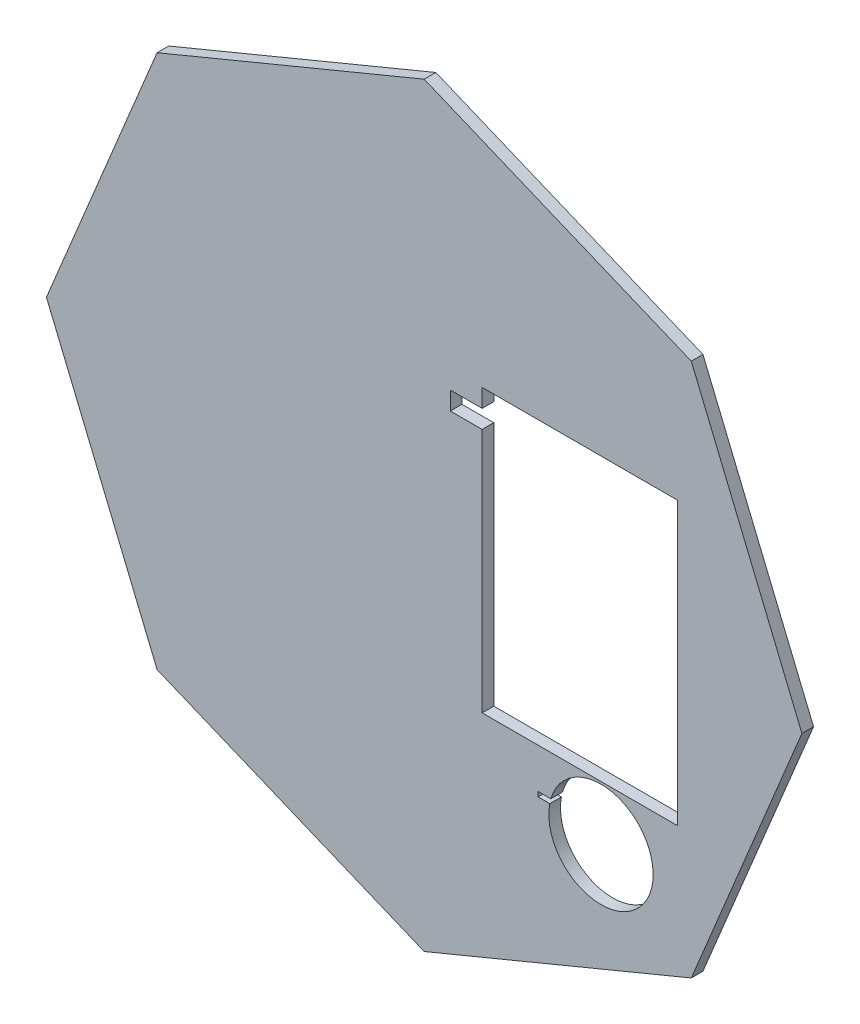
ISO-10303-21;
HEADER;
FILE_DESCRIPTION(('STEP AP214'),'2;1');
FILE_NAME('part.step','',(''),(''),'','','');
FILE_SCHEMA(('AUTOMOTIVE_DESIGN { 1 0 10303 214 1 1 1 1 }'));
ENDSEC;
DATA;
#1=APPLICATION_CONTEXT('core data for automotive mechanical design processes');
#2=APPLICATION_PROTOCOL_DEFINITION('international standard','automotive_design',2000,#1);
#3=PRODUCT_CONTEXT('',#1,'mechanical');
#4=PRODUCT('Part','Part','',(#3));
#5=PRODUCT_RELATED_PRODUCT_CATEGORY('part','',(#4));
#6=PRODUCT_DEFINITION_FORMATION('','',#4);
#7=PRODUCT_DEFINITION_CONTEXT('part definition',#1,'design');
#8=PRODUCT_DEFINITION('design','',#6,#7);
#9=PRODUCT_DEFINITION_SHAPE('','',#8);
#10=(LENGTH_UNIT() NAMED_UNIT(*) SI_UNIT(.MILLI.,.METRE.));
#11=(NAMED_UNIT(*) PLANE_ANGLE_UNIT() SI_UNIT($,.RADIAN.));
#12=(NAMED_UNIT(*) SI_UNIT($,.STERADIAN.) SOLID_ANGLE_UNIT());
#13=UNCERTAINTY_MEASURE_WITH_UNIT(LENGTH_MEASURE(1.E-05),#10,'distance_accuracy_value','');
#14=(GEOMETRIC_REPRESENTATION_CONTEXT(3) GLOBAL_UNCERTAINTY_ASSIGNED_CONTEXT((#13)) GLOBAL_UNIT_ASSIGNED_CONTEXT((#10,
#11,#12)) REPRESENTATION_CONTEXT('',''));
#15=CARTESIAN_POINT('',(0.,0.,0.));
#16=DIRECTION('',(0.,0.,1.));
#17=DIRECTION('',(1.,0.,0.));
#18=AXIS2_PLACEMENT_3D('',#15,#16,#17);
#19=CARTESIAN_POINT('',(0.,0.,13.2099665865153));
#20=DIRECTION('',(0.,0.,1.));
#21=DIRECTION('',(1.,0.,0.));
#22=AXIS2_PLACEMENT_3D('',#19,#20,#21);
#23=PLANE('',#22);
#24=DIRECTION('',(0.,-1.,0.));
#25=VECTOR('',#24,1.);
#26=CARTESIAN_POINT('',(53.6957855668647,14.1177242344918,13.2099665865153));
#27=LINE('',#26,#25);
#28=CARTESIAN_POINT('',(53.6957855668647,14.1177242344918,13.2099665865153));
#29=VERTEX_POINT('',#28);
#30=CARTESIAN_POINT('',(53.6957855668647,-17.3782779627732,13.2099665865153));
#31=VERTEX_POINT('',#30);
#32=EDGE_CURVE('E207',#29,#31,#27,.T.);
#33=ORIENTED_EDGE('',*,*,#32,.F.);
#34=DIRECTION('',(1.,0.,0.));
#35=VECTOR('',#34,1.);
#36=CARTESIAN_POINT('',(53.6957855668647,14.1177242344918,13.2099665865153));
#37=LINE('',#36,#35);
#38=CARTESIAN_POINT('',(31.8517761674547,14.1177242344918,13.2099665865153));
#39=VERTEX_POINT('',#38);
#40=EDGE_CURVE('E223',#39,#29,#37,.T.);
#41=ORIENTED_EDGE('',*,*,#40,.F.);
#42=DIRECTION('',(0.,1.,0.));
#43=VECTOR('',#42,1.);
#44=CARTESIAN_POINT('',(31.8517761674547,14.1177242344918,13.2099665865153));
#45=LINE('',#44,#43);
#46=CARTESIAN_POINT('',(31.8517761674547,12.0857189244338,13.2099665865153));
#47=VERTEX_POINT('',#46);
#48=EDGE_CURVE('E220',#47,#39,#45,.T.);
#49=ORIENTED_EDGE('',*,*,#48,.F.);
#50=DIRECTION('',(1.,0.,0.));
#51=VECTOR('',#50,1.);
#52=CARTESIAN_POINT('',(28.2957764115947,12.0857189244338,13.2099665865153));
#53=LINE('',#52,#51);
#54=CARTESIAN_POINT('',(28.2957764115947,12.0857189244338,13.2099665865153));
#55=VERTEX_POINT('',#54);
#56=EDGE_CURVE('E218',#55,#47,#53,.T.);
#57=ORIENTED_EDGE('',*,*,#56,.F.);
#58=DIRECTION('',(0.,1.,0.));
#59=VECTOR('',#58,1.);
#60=CARTESIAN_POINT('',(28.2957764115947,12.0857189244338,13.2099665865153));
#61=LINE('',#60,#59);
#62=CARTESIAN_POINT('',(28.2957764115947,10.0537212437698,13.2099665865153));
#63=VERTEX_POINT('',#62);
#64=EDGE_CURVE('E216',#63,#55,#61,.T.);
#65=ORIENTED_EDGE('',*,*,#64,.F.);
#66=DIRECTION('',(-1.,0.,0.));
#67=VECTOR('',#66,1.);
#68=CARTESIAN_POINT('',(28.2957764115947,10.0537212437698,13.2099665865153));
#69=LINE('',#68,#67);
#70=CARTESIAN_POINT('',(31.8517761674547,10.0537212437698,13.2099665865153));
#71=VERTEX_POINT('',#70);
#72=EDGE_CURVE('E214',#71,#63,#69,.T.);
#73=ORIENTED_EDGE('',*,*,#72,.F.);
#74=DIRECTION('',(0.,1.,0.));
#75=VECTOR('',#74,1.);
#76=CARTESIAN_POINT('',(31.8517761674547,10.0537212437698,13.2099665865153));
#77=LINE('',#76,#75);
#78=CARTESIAN_POINT('',(31.8517761674547,-17.3782779627732,13.2099665865153));
#79=VERTEX_POINT('',#78);
#80=EDGE_CURVE('E212',#79,#71,#77,.T.);
#81=ORIENTED_EDGE('',*,*,#80,.F.);
#82=DIRECTION('',(-1.,0.,0.));
#83=VECTOR('',#82,1.);
#84=CARTESIAN_POINT('',(53.6957855668647,-17.3782779627732,13.2099665865153));
#85=LINE('',#84,#83);
#86=EDGE_CURVE('E209',#31,#79,#85,.T.);
#87=ORIENTED_EDGE('',*,*,#86,.F.);
#88=EDGE_LOOP('',(#33,#41,#49,#57,#65,#73,#81,#87));
#89=FACE_BOUND('',#88,.T.);
#90=DIRECTION('',(-0.382687083310969,-0.923878020231537,0.));
#91=VECTOR('',#90,1.);
#92=CARTESIAN_POINT('',(67.5877838578847,-1.50327796277321,13.2099665865153));
#93=LINE('',#92,#91);
#94=CARTESIAN_POINT('',(67.5877838578847,-1.50327796277321,13.2099665865153));
#95=VERTEX_POINT('',#94);
#96=CARTESIAN_POINT('',(55.2237854447947,-31.3522769862112,13.2099665865153));
#97=VERTEX_POINT('',#96);
#98=EDGE_CURVE('E266',#95,#97,#93,.T.);
#99=ORIENTED_EDGE('',*,*,#98,.T.);
#100=DIRECTION('',(-0.923878013069668,-0.382687100601055,0.));
#101=VECTOR('',#100,1.);
#102=CARTESIAN_POINT('',(55.2237854447947,-31.3522769862112,13.2099665865153));
#103=LINE('',#102,#101);
#104=CARTESIAN_POINT('',(25.3747787919647,-43.7162792139942,13.2099665865153));
#105=VERTEX_POINT('',#104);
#106=EDGE_CURVE('E269',#97,#105,#103,.T.);
#107=ORIENTED_EDGE('',*,*,#106,.T.);
#108=DIRECTION('',(-0.923877978486666,0.38268718409086,0.));
#109=VECTOR('',#108,1.);
#110=CARTESIAN_POINT('',(25.3747787919647,-43.7162792139942,13.2099665865153));
#111=LINE('',#110,#109);
#112=CARTESIAN_POINT('',(-4.47422023146928,-31.3522769862112,13.2099665865153));
#113=VERTEX_POINT('',#112);
#114=EDGE_CURVE('E272',#105,#113,#111,.T.);
#115=ORIENTED_EDGE('',*,*,#114,.T.);
#116=DIRECTION('',(-0.382687184090816,0.923877978486684,0.));
#117=VECTOR('',#116,1.);
#118=CARTESIAN_POINT('',(-4.47422023146928,-31.3522769862112,13.2099665865153));
#119=LINE('',#118,#117);
#120=CARTESIAN_POINT('',(-16.8382224592523,-1.50327796277321,13.2099665865153));
#121=VERTEX_POINT('',#120);
#122=EDGE_CURVE('E274',#113,#121,#119,.T.);
#123=ORIENTED_EDGE('',*,*,#122,.T.);
#124=DIRECTION('',(0.382687184090915,0.923877978486643,0.));
#125=VECTOR('',#124,1.);
#126=CARTESIAN_POINT('',(-16.8382224592523,-1.50327796277321,13.2099665865153));
#127=LINE('',#126,#125);
#128=CARTESIAN_POINT('',(-4.47422023146928,28.3457210606558,13.2099665865153));
#129=VERTEX_POINT('',#128);
#130=EDGE_CURVE('E276',#121,#129,#127,.T.);
#131=ORIENTED_EDGE('',*,*,#130,.T.);
#132=DIRECTION('',(0.923878020231519,0.382687083311013,0.));
#133=VECTOR('',#132,1.);
#134=CARTESIAN_POINT('',(-4.47422023146928,28.3457210606558,13.2099665865153));
#135=LINE('',#134,#133);
#136=CARTESIAN_POINT('',(25.3747787919647,40.7097194737458,13.2099665865153));
#137=VERTEX_POINT('',#136);
#138=EDGE_CURVE('E278',#129,#137,#135,.T.);
#139=ORIENTED_EDGE('',*,*,#138,.T.);
#140=DIRECTION('',(0.923878054814504,-0.382686999821222,0.));
#141=VECTOR('',#140,1.);
#142=CARTESIAN_POINT('',(25.3747787919647,40.7097194737458,13.2099665865153));
#143=LINE('',#142,#141);
#144=CARTESIAN_POINT('',(55.2237854447947,28.3457210606558,13.2099665865153));
#145=VERTEX_POINT('',#144);
#146=EDGE_CURVE('E280',#137,#145,#143,.T.);
#147=ORIENTED_EDGE('',*,*,#146,.T.);
#148=DIRECTION('',(0.382687083311067,-0.923878020231496,0.));
#149=VECTOR('',#148,1.);
#150=CARTESIAN_POINT('',(55.2237854447947,28.3457210606558,13.2099665865153));
#151=LINE('',#150,#149);
#152=EDGE_CURVE('E282',#145,#95,#151,.T.);
#153=ORIENTED_EDGE('',*,*,#152,.T.);
#154=EDGE_LOOP('',(#99,#107,#115,#123,#131,#139,#147,#153));
#155=FACE_BOUND('',#154,.T.);
#156=DIRECTION('',(0.,1.,0.));
#157=VECTOR('',#156,1.);
#158=CARTESIAN_POINT('',(38.1017761674547,-21.8602764063772,13.2099665865153));
#159=LINE('',#158,#157);
#160=CARTESIAN_POINT('',(38.1017761674547,-22.3850899845759,13.2099665865153));
#161=VERTEX_POINT('',#160);
#162=CARTESIAN_POINT('',(38.1017761674547,-21.8602764063772,13.2099665865153));
#163=VERTEX_POINT('',#162);
#164=EDGE_CURVE('E171',#161,#163,#159,.T.);
#165=ORIENTED_EDGE('',*,*,#164,.F.);
#166=DIRECTION('',(-1.,0.,0.));
#167=VECTOR('',#166,1.);
#168=CARTESIAN_POINT('',(38.1017761674547,-22.3850899845759,13.2099665865153));
#169=LINE('',#168,#167);
#170=CARTESIAN_POINT('',(39.404542799572,-22.3850899845759,13.2099665865153));
#171=VERTEX_POINT('',#170);
#172=EDGE_CURVE('E193',#171,#161,#169,.T.);
#173=ORIENTED_EDGE('',*,*,#172,.F.);
#174=CARTESIAN_POINT('',(45.1309741122147,-23.4672767573292,13.2099665865153));
#175=DIRECTION('',(0.,0.,-1.));
#176=DIRECTION('',(-1.,0.,0.));
#177=AXIS2_PLACEMENT_3D('',#174,#175,#176);
#178=CIRCLE('',#177,5.82779064393505);
#179=CARTESIAN_POINT('',(39.5291267685631,-21.8602764063772,13.2099665865153));
#180=VERTEX_POINT('',#179);
#181=EDGE_CURVE('E191',#180,#171,#178,.T.);
#182=ORIENTED_EDGE('',*,*,#181,.F.);
#183=DIRECTION('',(1.,0.,0.));
#184=VECTOR('',#183,1.);
#185=CARTESIAN_POINT('',(38.1017761674547,-21.8602764063772,13.2099665865153));
#186=LINE('',#185,#184);
#187=EDGE_CURVE('E179',#163,#180,#186,.T.);
#188=ORIENTED_EDGE('',*,*,#187,.F.);
#189=EDGE_LOOP('',(#165,#173,#182,#188));
#190=FACE_BOUND('',#189,.T.);
#191=ADVANCED_FACE('F34',(#89,#155,#190),#23,.F.);
#192=CARTESIAN_POINT('',(0.,0.,14.5099665865153));
#193=DIRECTION('',(0.,0.,1.));
#194=DIRECTION('',(1.,0.,0.));
#195=AXIS2_PLACEMENT_3D('',#192,#193,#194);
#196=PLANE('',#195);
#197=DIRECTION('',(-0.382687083310969,-0.923878020231537,0.));
#198=VECTOR('',#197,1.);
#199=CARTESIAN_POINT('',(67.5877838578847,-1.50327796277321,14.5099665865153));
#200=LINE('',#199,#198);
#201=CARTESIAN_POINT('',(67.5877838578847,-1.50327796277321,14.5099665865153));
#202=VERTEX_POINT('',#201);
#203=CARTESIAN_POINT('',(55.2237854447947,-31.3522769862112,14.5099665865153));
#204=VERTEX_POINT('',#203);
#205=EDGE_CURVE('E265',#202,#204,#200,.T.);
#206=ORIENTED_EDGE('',*,*,#205,.F.);
#207=DIRECTION('',(0.382687083311067,-0.923878020231496,0.));
#208=VECTOR('',#207,1.);
#209=CARTESIAN_POINT('',(55.2237854447947,28.3457210606558,14.5099665865153));
#210=LINE('',#209,#208);
#211=CARTESIAN_POINT('',(55.2237854447947,28.3457210606558,14.5099665865153));
#212=VERTEX_POINT('',#211);
#213=EDGE_CURVE('E270',#212,#202,#210,.T.);
#214=ORIENTED_EDGE('',*,*,#213,.F.);
#215=DIRECTION('',(0.923878054814504,-0.382686999821222,0.));
#216=VECTOR('',#215,1.);
#217=CARTESIAN_POINT('',(25.3747787919647,40.7097194737458,14.5099665865153));
#218=LINE('',#217,#216);
#219=CARTESIAN_POINT('',(25.3747787919647,40.7097194737458,14.5099665865153));
#220=VERTEX_POINT('',#219);
#221=EDGE_CURVE('E297',#220,#212,#218,.T.);
#222=ORIENTED_EDGE('',*,*,#221,.F.);
#223=DIRECTION('',(0.923878020231519,0.382687083311013,0.));
#224=VECTOR('',#223,1.);
#225=CARTESIAN_POINT('',(-4.47422023146928,28.3457210606558,14.5099665865153));
#226=LINE('',#225,#224);
#227=CARTESIAN_POINT('',(-4.47422023146928,28.3457210606558,14.5099665865153));
#228=VERTEX_POINT('',#227);
#229=EDGE_CURVE('E295',#228,#220,#226,.T.);
#230=ORIENTED_EDGE('',*,*,#229,.F.);
#231=DIRECTION('',(0.382687184090915,0.923877978486643,0.));
#232=VECTOR('',#231,1.);
#233=CARTESIAN_POINT('',(-16.8382224592523,-1.50327796277321,14.5099665865153));
#234=LINE('',#233,#232);
#235=CARTESIAN_POINT('',(-16.8382224592523,-1.50327796277321,14.5099665865153));
#236=VERTEX_POINT('',#235);
#237=EDGE_CURVE('E293',#236,#228,#234,.T.);
#238=ORIENTED_EDGE('',*,*,#237,.F.);
#239=DIRECTION('',(-0.382687184090816,0.923877978486684,0.));
#240=VECTOR('',#239,1.);
#241=CARTESIAN_POINT('',(-4.47422023146928,-31.3522769862112,14.5099665865153));
#242=LINE('',#241,#240);
#243=CARTESIAN_POINT('',(-4.47422023146928,-31.3522769862112,14.5099665865153));
#244=VERTEX_POINT('',#243);
#245=EDGE_CURVE('E291',#244,#236,#242,.T.);
#246=ORIENTED_EDGE('',*,*,#245,.F.);
#247=DIRECTION('',(-0.923877978486666,0.38268718409086,0.));
#248=VECTOR('',#247,1.);
#249=CARTESIAN_POINT('',(25.3747787919647,-43.7162792139942,14.5099665865153));
#250=LINE('',#249,#248);
#251=CARTESIAN_POINT('',(25.3747787919647,-43.7162792139942,14.5099665865153));
#252=VERTEX_POINT('',#251);
#253=EDGE_CURVE('E289',#252,#244,#250,.T.);
#254=ORIENTED_EDGE('',*,*,#253,.F.);
#255=DIRECTION('',(-0.923878013069668,-0.382687100601055,0.));
#256=VECTOR('',#255,1.);
#257=CARTESIAN_POINT('',(55.2237854447947,-31.3522769862112,14.5099665865153));
#258=LINE('',#257,#256);
#259=EDGE_CURVE('E287',#204,#252,#258,.T.);
#260=ORIENTED_EDGE('',*,*,#259,.F.);
#261=EDGE_LOOP('',(#206,#214,#222,#230,#238,#246,#254,#260));
#262=FACE_BOUND('',#261,.T.);
#263=DIRECTION('',(1.,0.,0.));
#264=VECTOR('',#263,1.);
#265=CARTESIAN_POINT('',(53.6957855668647,14.1177242344918,14.5099665865153));
#266=LINE('',#265,#264);
#267=CARTESIAN_POINT('',(31.8517761674547,14.1177242344918,14.5099665865153));
#268=VERTEX_POINT('',#267);
#269=CARTESIAN_POINT('',(53.6957855668647,14.1177242344918,14.5099665865153));
#270=VERTEX_POINT('',#269);
#271=EDGE_CURVE('E210',#268,#270,#266,.T.);
#272=ORIENTED_EDGE('',*,*,#271,.T.);
#273=DIRECTION('',(0.,-1.,0.));
#274=VECTOR('',#273,1.);
#275=CARTESIAN_POINT('',(53.6957855668647,14.1177242344918,14.5099665865153));
#276=LINE('',#275,#274);
#277=CARTESIAN_POINT('',(53.6957855668647,-17.3782779627732,14.5099665865153));
#278=VERTEX_POINT('',#277);
#279=EDGE_CURVE('E187',#270,#278,#276,.T.);
#280=ORIENTED_EDGE('',*,*,#279,.T.);
#281=DIRECTION('',(-1.,0.,0.));
#282=VECTOR('',#281,1.);
#283=CARTESIAN_POINT('',(53.6957855668647,-17.3782779627732,14.5099665865153));
#284=LINE('',#283,#282);
#285=CARTESIAN_POINT('',(31.8517761674547,-17.3782779627732,14.5099665865153));
#286=VERTEX_POINT('',#285);
#287=EDGE_CURVE('E228',#278,#286,#284,.T.);
#288=ORIENTED_EDGE('',*,*,#287,.T.);
#289=DIRECTION('',(0.,1.,0.));
#290=VECTOR('',#289,1.);
#291=CARTESIAN_POINT('',(31.8517761674547,10.0537212437698,14.5099665865153));
#292=LINE('',#291,#290);
#293=CARTESIAN_POINT('',(31.8517761674547,10.0537212437698,14.5099665865153));
#294=VERTEX_POINT('',#293);
#295=EDGE_CURVE('E231',#286,#294,#292,.T.);
#296=ORIENTED_EDGE('',*,*,#295,.T.);
#297=DIRECTION('',(-1.,0.,0.));
#298=VECTOR('',#297,1.);
#299=CARTESIAN_POINT('',(28.2957764115947,10.0537212437698,14.5099665865153));
#300=LINE('',#299,#298);
#301=CARTESIAN_POINT('',(28.2957764115947,10.0537212437698,14.5099665865153));
#302=VERTEX_POINT('',#301);
#303=EDGE_CURVE('E234',#294,#302,#300,.T.);
#304=ORIENTED_EDGE('',*,*,#303,.T.);
#305=DIRECTION('',(0.,1.,0.));
#306=VECTOR('',#305,1.);
#307=CARTESIAN_POINT('',(28.2957764115947,12.0857189244338,14.5099665865153));
#308=LINE('',#307,#306);
#309=CARTESIAN_POINT('',(28.2957764115947,12.0857189244338,14.5099665865153));
#310=VERTEX_POINT('',#309);
#311=EDGE_CURVE('E237',#302,#310,#308,.T.);
#312=ORIENTED_EDGE('',*,*,#311,.T.);
#313=DIRECTION('',(1.,0.,0.));
#314=VECTOR('',#313,1.);
#315=CARTESIAN_POINT('',(28.2957764115947,12.0857189244338,14.5099665865153));
#316=LINE('',#315,#314);
#317=CARTESIAN_POINT('',(31.8517761674547,12.0857189244338,14.5099665865153));
#318=VERTEX_POINT('',#317);
#319=EDGE_CURVE('E240',#310,#318,#316,.T.);
#320=ORIENTED_EDGE('',*,*,#319,.T.);
#321=DIRECTION('',(0.,1.,0.));
#322=VECTOR('',#321,1.);
#323=CARTESIAN_POINT('',(31.8517761674547,14.1177242344918,14.5099665865153));
#324=LINE('',#323,#322);
#325=EDGE_CURVE('E243',#318,#268,#324,.T.);
#326=ORIENTED_EDGE('',*,*,#325,.T.);
#327=EDGE_LOOP('',(#272,#280,#288,#296,#304,#312,#320,#326));
#328=FACE_BOUND('',#327,.T.);
#329=DIRECTION('',(-1.,0.,0.));
#330=VECTOR('',#329,1.);
#331=CARTESIAN_POINT('',(38.1017761674547,-22.3850899845759,14.5099665865153));
#332=LINE('',#331,#330);
#333=CARTESIAN_POINT('',(39.404542799572,-22.3850899845759,14.5099665865153));
#334=VERTEX_POINT('',#333);
#335=CARTESIAN_POINT('',(38.1017761674547,-22.3850899845759,14.5099665865153));
#336=VERTEX_POINT('',#335);
#337=EDGE_CURVE('E180',#334,#336,#332,.T.);
#338=ORIENTED_EDGE('',*,*,#337,.T.);
#339=DIRECTION('',(0.,1.,0.));
#340=VECTOR('',#339,1.);
#341=CARTESIAN_POINT('',(38.1017761674547,-21.8602764063772,14.5099665865153));
#342=LINE('',#341,#340);
#343=CARTESIAN_POINT('',(38.1017761674547,-21.8602764063772,14.5099665865153));
#344=VERTEX_POINT('',#343);
#345=EDGE_CURVE('E57',#336,#344,#342,.T.);
#346=ORIENTED_EDGE('',*,*,#345,.T.);
#347=DIRECTION('',(1.,0.,0.));
#348=VECTOR('',#347,1.);
#349=CARTESIAN_POINT('',(38.1017761674547,-21.8602764063772,14.5099665865153));
#350=LINE('',#349,#348);
#351=CARTESIAN_POINT('',(39.5291267685631,-21.8602764063772,14.5099665865153));
#352=VERTEX_POINT('',#351);
#353=EDGE_CURVE('E186',#344,#352,#350,.T.);
#354=ORIENTED_EDGE('',*,*,#353,.T.);
#355=CARTESIAN_POINT('',(45.1309741122147,-23.4672767573292,14.5099665865153));
#356=DIRECTION('',(0.,0.,-1.));
#357=DIRECTION('',(-1.,0.,0.));
#358=AXIS2_PLACEMENT_3D('',#355,#356,#357);
#359=CIRCLE('',#358,5.82779064393505);
#360=EDGE_CURVE('E199',#352,#334,#359,.T.);
#361=ORIENTED_EDGE('',*,*,#360,.T.);
#362=EDGE_LOOP('',(#338,#346,#354,#361));
#363=FACE_BOUND('',#362,.T.);
#364=ADVANCED_FACE('F327',(#262,#328,#363),#196,.T.);
#365=CARTESIAN_POINT('',(67.5877838578847,-1.50327796277321,13.2099665865153));
#366=DIRECTION('',(-0.923878020231537,0.382687083310969,0.));
#367=DIRECTION('',(-0.382687083310969,-0.923878020231537,0.));
#368=AXIS2_PLACEMENT_3D('',#365,#366,#367);
#369=PLANE('',#368);
#370=ORIENTED_EDGE('',*,*,#205,.T.);
#371=DIRECTION('',(0.,0.,1.));
#372=VECTOR('',#371,1.);
#373=CARTESIAN_POINT('',(55.2237854447947,-31.3522769862112,13.2099665865153));
#374=LINE('',#373,#372);
#375=EDGE_CURVE('E11',#97,#204,#374,.T.);
#376=ORIENTED_EDGE('',*,*,#375,.F.);
#377=ORIENTED_EDGE('',*,*,#98,.F.);
#378=DIRECTION('',(0.,0.,1.));
#379=VECTOR('',#378,1.);
#380=CARTESIAN_POINT('',(67.5877838578847,-1.50327796277321,13.2099665865153));
#381=LINE('',#380,#379);
#382=EDGE_CURVE('E284',#95,#202,#381,.T.);
#383=ORIENTED_EDGE('',*,*,#382,.T.);
#384=EDGE_LOOP('',(#370,#376,#377,#383));
#385=FACE_BOUND('',#384,.T.);
#386=ADVANCED_FACE('F36',(#385),#369,.F.);
#387=CARTESIAN_POINT('',(55.2237854447947,-31.3522769862112,13.2099665865153));
#388=DIRECTION('',(-0.382687100601055,0.923878013069668,0.));
#389=DIRECTION('',(-0.923878013069668,-0.382687100601055,0.));
#390=AXIS2_PLACEMENT_3D('',#387,#388,#389);
#391=PLANE('',#390);
#392=ORIENTED_EDGE('',*,*,#259,.T.);
#393=DIRECTION('',(0.,0.,1.));
#394=VECTOR('',#393,1.);
#395=CARTESIAN_POINT('',(25.3747787919647,-43.7162792139942,13.2099665865153));
#396=LINE('',#395,#394);
#397=EDGE_CURVE('E42',#105,#252,#396,.T.);
#398=ORIENTED_EDGE('',*,*,#397,.F.);
#399=ORIENTED_EDGE('',*,*,#106,.F.);
#400=ORIENTED_EDGE('',*,*,#375,.T.);
#401=EDGE_LOOP('',(#392,#398,#399,#400));
#402=FACE_BOUND('',#401,.T.);
#403=ADVANCED_FACE('F344',(#402),#391,.F.);
#404=CARTESIAN_POINT('',(25.3747787919647,-43.7162792139942,13.2099665865153));
#405=DIRECTION('',(0.38268718409086,0.923877978486666,0.));
#406=DIRECTION('',(-0.923877978486666,0.38268718409086,0.));
#407=AXIS2_PLACEMENT_3D('',#404,#405,#406);
#408=PLANE('',#407);
#409=ORIENTED_EDGE('',*,*,#253,.T.);
#410=DIRECTION('',(0.,0.,1.));
#411=VECTOR('',#410,1.);
#412=CARTESIAN_POINT('',(-4.47422023146928,-31.3522769862112,13.2099665865153));
#413=LINE('',#412,#411);
#414=EDGE_CURVE('E314',#113,#244,#413,.T.);
#415=ORIENTED_EDGE('',*,*,#414,.F.);
#416=ORIENTED_EDGE('',*,*,#114,.F.);
#417=ORIENTED_EDGE('',*,*,#397,.T.);
#418=EDGE_LOOP('',(#409,#415,#416,#417));
#419=FACE_BOUND('',#418,.T.);
#420=ADVANCED_FACE('F321',(#419),#408,.F.);
#421=CARTESIAN_POINT('',(-4.47422023146928,-31.3522769862112,13.2099665865153));
#422=DIRECTION('',(0.923877978486684,0.382687184090816,0.));
#423=DIRECTION('',(-0.382687184090816,0.923877978486684,0.));
#424=AXIS2_PLACEMENT_3D('',#421,#422,#423);
#425=PLANE('',#424);
#426=ORIENTED_EDGE('',*,*,#245,.T.);
#427=DIRECTION('',(0.,0.,1.));
#428=VECTOR('',#427,1.);
#429=CARTESIAN_POINT('',(-16.8382224592523,-1.50327796277321,13.2099665865153));
#430=LINE('',#429,#428);
#431=EDGE_CURVE('E311',#121,#236,#430,.T.);
#432=ORIENTED_EDGE('',*,*,#431,.F.);
#433=ORIENTED_EDGE('',*,*,#122,.F.);
#434=ORIENTED_EDGE('',*,*,#414,.T.);
#435=EDGE_LOOP('',(#426,#432,#433,#434));
#436=FACE_BOUND('',#435,.T.);
#437=ADVANCED_FACE('F333',(#436),#425,.F.);
#438=CARTESIAN_POINT('',(-16.8382224592523,-1.50327796277321,13.2099665865153));
#439=DIRECTION('',(0.923877978486643,-0.382687184090915,0.));
#440=DIRECTION('',(0.382687184090915,0.923877978486643,0.));
#441=AXIS2_PLACEMENT_3D('',#438,#439,#440);
#442=PLANE('',#441);
#443=ORIENTED_EDGE('',*,*,#237,.T.);
#444=DIRECTION('',(0.,0.,1.));
#445=VECTOR('',#444,1.);
#446=CARTESIAN_POINT('',(-4.47422023146928,28.3457210606558,13.2099665865153));
#447=LINE('',#446,#445);
#448=EDGE_CURVE('E308',#129,#228,#447,.T.);
#449=ORIENTED_EDGE('',*,*,#448,.F.);
#450=ORIENTED_EDGE('',*,*,#130,.F.);
#451=ORIENTED_EDGE('',*,*,#431,.T.);
#452=EDGE_LOOP('',(#443,#449,#450,#451));
#453=FACE_BOUND('',#452,.T.);
#454=ADVANCED_FACE('F337',(#453),#442,.F.);
#455=CARTESIAN_POINT('',(-4.47422023146928,28.3457210606558,13.2099665865153));
#456=DIRECTION('',(0.382687083311012,-0.923878020231519,0.));
#457=DIRECTION('',(0.923878020231519,0.382687083311012,0.));
#458=AXIS2_PLACEMENT_3D('',#455,#456,#457);
#459=PLANE('',#458);
#460=ORIENTED_EDGE('',*,*,#229,.T.);
#461=DIRECTION('',(0.,0.,1.));
#462=VECTOR('',#461,1.);
#463=CARTESIAN_POINT('',(25.3747787919647,40.7097194737458,13.2099665865153));
#464=LINE('',#463,#462);
#465=EDGE_CURVE('E305',#137,#220,#464,.T.);
#466=ORIENTED_EDGE('',*,*,#465,.F.);
#467=ORIENTED_EDGE('',*,*,#138,.F.);
#468=ORIENTED_EDGE('',*,*,#448,.T.);
#469=EDGE_LOOP('',(#460,#466,#467,#468));
#470=FACE_BOUND('',#469,.T.);
#471=ADVANCED_FACE('F357',(#470),#459,.F.);
#472=CARTESIAN_POINT('',(25.3747787919647,40.7097194737458,13.2099665865153));
#473=DIRECTION('',(-0.382686999821222,-0.923878054814504,0.));
#474=DIRECTION('',(0.923878054814504,-0.382686999821222,0.));
#475=AXIS2_PLACEMENT_3D('',#472,#473,#474);
#476=PLANE('',#475);
#477=ORIENTED_EDGE('',*,*,#221,.T.);
#478=DIRECTION('',(0.,0.,1.));
#479=VECTOR('',#478,1.);
#480=CARTESIAN_POINT('',(55.2237854447947,28.3457210606558,13.2099665865153));
#481=LINE('',#480,#479);
#482=EDGE_CURVE('E302',#145,#212,#481,.T.);
#483=ORIENTED_EDGE('',*,*,#482,.F.);
#484=ORIENTED_EDGE('',*,*,#146,.F.);
#485=ORIENTED_EDGE('',*,*,#465,.T.);
#486=EDGE_LOOP('',(#477,#483,#484,#485));
#487=FACE_BOUND('',#486,.T.);
#488=ADVANCED_FACE('F355',(#487),#476,.F.);
#489=CARTESIAN_POINT('',(55.2237854447947,28.3457210606558,13.2099665865153));
#490=DIRECTION('',(-0.923878020231496,-0.382687083311067,0.));
#491=DIRECTION('',(0.382687083311067,-0.923878020231496,0.));
#492=AXIS2_PLACEMENT_3D('',#489,#490,#491);
#493=PLANE('',#492);
#494=ORIENTED_EDGE('',*,*,#213,.T.);
#495=ORIENTED_EDGE('',*,*,#382,.F.);
#496=ORIENTED_EDGE('',*,*,#152,.F.);
#497=ORIENTED_EDGE('',*,*,#482,.T.);
#498=EDGE_LOOP('',(#494,#495,#496,#497));
#499=FACE_BOUND('',#498,.T.);
#500=ADVANCED_FACE('F350',(#499),#493,.F.);
#501=CARTESIAN_POINT('',(53.6957855668647,14.1177242344918,13.2099665865153));
#502=DIRECTION('',(-1.,0.,0.));
#503=DIRECTION('',(0.,-1.,0.));
#504=AXIS2_PLACEMENT_3D('',#501,#502,#503);
#505=PLANE('',#504);
#506=ORIENTED_EDGE('',*,*,#279,.F.);
#507=DIRECTION('',(0.,0.,1.));
#508=VECTOR('',#507,1.);
#509=CARTESIAN_POINT('',(53.6957855668647,14.1177242344918,13.2099665865153));
#510=LINE('',#509,#508);
#511=EDGE_CURVE('E225',#29,#270,#510,.T.);
#512=ORIENTED_EDGE('',*,*,#511,.F.);
#513=ORIENTED_EDGE('',*,*,#32,.T.);
#514=DIRECTION('',(0.,0.,1.));
#515=VECTOR('',#514,1.);
#516=CARTESIAN_POINT('',(53.6957855668647,-17.3782779627732,13.2099665865153));
#517=LINE('',#516,#515);
#518=EDGE_CURVE('E262',#31,#278,#517,.T.);
#519=ORIENTED_EDGE('',*,*,#518,.T.);
#520=EDGE_LOOP('',(#506,#512,#513,#519));
#521=FACE_BOUND('',#520,.T.);
#522=ADVANCED_FACE('F375',(#521),#505,.T.);
#523=CARTESIAN_POINT('',(53.6957855668647,-17.3782779627732,13.2099665865153));
#524=DIRECTION('',(0.,1.,0.));
#525=DIRECTION('',(0.,0.,1.));
#526=AXIS2_PLACEMENT_3D('',#523,#524,#525);
#527=PLANE('',#526);
#528=ORIENTED_EDGE('',*,*,#287,.F.);
#529=ORIENTED_EDGE('',*,*,#518,.F.);
#530=ORIENTED_EDGE('',*,*,#86,.T.);
#531=DIRECTION('',(0.,0.,1.));
#532=VECTOR('',#531,1.);
#533=CARTESIAN_POINT('',(31.8517761674547,-17.3782779627732,13.2099665865153));
#534=LINE('',#533,#532);
#535=EDGE_CURVE('E260',#79,#286,#534,.T.);
#536=ORIENTED_EDGE('',*,*,#535,.T.);
#537=EDGE_LOOP('',(#528,#529,#530,#536));
#538=FACE_BOUND('',#537,.T.);
#539=ADVANCED_FACE('F382',(#538),#527,.T.);
#540=CARTESIAN_POINT('',(31.8517761674547,10.0537212437698,13.2099665865153));
#541=DIRECTION('',(1.,0.,0.));
#542=DIRECTION('',(0.,0.,-1.));
#543=AXIS2_PLACEMENT_3D('',#540,#541,#542);
#544=PLANE('',#543);
#545=ORIENTED_EDGE('',*,*,#295,.F.);
#546=ORIENTED_EDGE('',*,*,#535,.F.);
#547=ORIENTED_EDGE('',*,*,#80,.T.);
#548=DIRECTION('',(0.,0.,1.));
#549=VECTOR('',#548,1.);
#550=CARTESIAN_POINT('',(31.8517761674547,10.0537212437698,13.2099665865153));
#551=LINE('',#550,#549);
#552=EDGE_CURVE('E258',#71,#294,#551,.T.);
#553=ORIENTED_EDGE('',*,*,#552,.T.);
#554=EDGE_LOOP('',(#545,#546,#547,#553));
#555=FACE_BOUND('',#554,.T.);
#556=ADVANCED_FACE('F387',(#555),#544,.T.);
#557=CARTESIAN_POINT('',(28.2957764115947,10.0537212437698,13.2099665865153));
#558=DIRECTION('',(0.,1.,0.));
#559=DIRECTION('',(0.,0.,1.));
#560=AXIS2_PLACEMENT_3D('',#557,#558,#559);
#561=PLANE('',#560);
#562=ORIENTED_EDGE('',*,*,#303,.F.);
#563=ORIENTED_EDGE('',*,*,#552,.F.);
#564=ORIENTED_EDGE('',*,*,#72,.T.);
#565=DIRECTION('',(0.,0.,1.));
#566=VECTOR('',#565,1.);
#567=CARTESIAN_POINT('',(28.2957764115947,10.0537212437698,13.2099665865153));
#568=LINE('',#567,#566);
#569=EDGE_CURVE('E256',#63,#302,#568,.T.);
#570=ORIENTED_EDGE('',*,*,#569,.T.);
#571=EDGE_LOOP('',(#562,#563,#564,#570));
#572=FACE_BOUND('',#571,.T.);
#573=ADVANCED_FACE('F412',(#572),#561,.T.);
#574=CARTESIAN_POINT('',(28.2957764115947,12.0857189244338,13.2099665865153));
#575=DIRECTION('',(1.,0.,0.));
#576=DIRECTION('',(0.,0.,-1.));
#577=AXIS2_PLACEMENT_3D('',#574,#575,#576);
#578=PLANE('',#577);
#579=ORIENTED_EDGE('',*,*,#311,.F.);
#580=ORIENTED_EDGE('',*,*,#569,.F.);
#581=ORIENTED_EDGE('',*,*,#64,.T.);
#582=DIRECTION('',(0.,0.,1.));
#583=VECTOR('',#582,1.);
#584=CARTESIAN_POINT('',(28.2957764115947,12.0857189244338,13.2099665865153));
#585=LINE('',#584,#583);
#586=EDGE_CURVE('E254',#55,#310,#585,.T.);
#587=ORIENTED_EDGE('',*,*,#586,.T.);
#588=EDGE_LOOP('',(#579,#580,#581,#587));
#589=FACE_BOUND('',#588,.T.);
#590=ADVANCED_FACE('F417',(#589),#578,.T.);
#591=CARTESIAN_POINT('',(28.2957764115947,12.0857189244338,13.2099665865153));
#592=DIRECTION('',(0.,-1.,0.));
#593=DIRECTION('',(0.,0.,-1.));
#594=AXIS2_PLACEMENT_3D('',#591,#592,#593);
#595=PLANE('',#594);
#596=ORIENTED_EDGE('',*,*,#319,.F.);
#597=ORIENTED_EDGE('',*,*,#586,.F.);
#598=ORIENTED_EDGE('',*,*,#56,.T.);
#599=DIRECTION('',(0.,0.,1.));
#600=VECTOR('',#599,1.);
#601=CARTESIAN_POINT('',(31.8517761674547,12.0857189244338,13.2099665865153));
#602=LINE('',#601,#600);
#603=EDGE_CURVE('E252',#47,#318,#602,.T.);
#604=ORIENTED_EDGE('',*,*,#603,.T.);
#605=EDGE_LOOP('',(#596,#597,#598,#604));
#606=FACE_BOUND('',#605,.T.);
#607=ADVANCED_FACE('F420',(#606),#595,.T.);
#608=CARTESIAN_POINT('',(31.8517761674547,14.1177242344918,13.2099665865153));
#609=DIRECTION('',(1.,0.,0.));
#610=DIRECTION('',(0.,0.,-1.));
#611=AXIS2_PLACEMENT_3D('',#608,#609,#610);
#612=PLANE('',#611);
#613=ORIENTED_EDGE('',*,*,#325,.F.);
#614=ORIENTED_EDGE('',*,*,#603,.F.);
#615=ORIENTED_EDGE('',*,*,#48,.T.);
#616=DIRECTION('',(0.,0.,1.));
#617=VECTOR('',#616,1.);
#618=CARTESIAN_POINT('',(31.8517761674547,14.1177242344918,13.2099665865153));
#619=LINE('',#618,#617);
#620=EDGE_CURVE('E250',#39,#268,#619,.T.);
#621=ORIENTED_EDGE('',*,*,#620,.T.);
#622=EDGE_LOOP('',(#613,#614,#615,#621));
#623=FACE_BOUND('',#622,.T.);
#624=ADVANCED_FACE('F400',(#623),#612,.T.);
#625=CARTESIAN_POINT('',(53.6957855668647,14.1177242344918,13.2099665865153));
#626=DIRECTION('',(0.,-1.,0.));
#627=DIRECTION('',(0.,0.,-1.));
#628=AXIS2_PLACEMENT_3D('',#625,#626,#627);
#629=PLANE('',#628);
#630=ORIENTED_EDGE('',*,*,#271,.F.);
#631=ORIENTED_EDGE('',*,*,#620,.F.);
#632=ORIENTED_EDGE('',*,*,#40,.T.);
#633=ORIENTED_EDGE('',*,*,#511,.T.);
#634=EDGE_LOOP('',(#630,#631,#632,#633));
#635=FACE_BOUND('',#634,.T.);
#636=ADVANCED_FACE('F393',(#635),#629,.T.);
#637=CARTESIAN_POINT('',(38.1017761674547,-21.8602764063772,13.2099665865153));
#638=DIRECTION('',(1.,0.,0.));
#639=DIRECTION('',(0.,0.,-1.));
#640=AXIS2_PLACEMENT_3D('',#637,#638,#639);
#641=PLANE('',#640);
#642=ORIENTED_EDGE('',*,*,#345,.F.);
#643=DIRECTION('',(0.,0.,1.));
#644=VECTOR('',#643,1.);
#645=CARTESIAN_POINT('',(38.1017761674547,-22.3850899845759,13.2099665865153));
#646=LINE('',#645,#644);
#647=EDGE_CURVE('E175',#161,#336,#646,.T.);
#648=ORIENTED_EDGE('',*,*,#647,.F.);
#649=ORIENTED_EDGE('',*,*,#164,.T.);
#650=DIRECTION('',(0.,0.,1.));
#651=VECTOR('',#650,1.);
#652=CARTESIAN_POINT('',(38.1017761674547,-21.8602764063772,13.2099665865153));
#653=LINE('',#652,#651);
#654=EDGE_CURVE('E174',#163,#344,#653,.T.);
#655=ORIENTED_EDGE('',*,*,#654,.T.);
#656=EDGE_LOOP('',(#642,#648,#649,#655));
#657=FACE_BOUND('',#656,.T.);
#658=ADVANCED_FACE('F173',(#657),#641,.T.);
#659=CARTESIAN_POINT('',(38.1017761674547,-21.8602764063772,13.2099665865153));
#660=DIRECTION('',(0.,-1.,0.));
#661=DIRECTION('',(0.,0.,-1.));
#662=AXIS2_PLACEMENT_3D('',#659,#660,#661);
#663=PLANE('',#662);
#664=ORIENTED_EDGE('',*,*,#353,.F.);
#665=ORIENTED_EDGE('',*,*,#654,.F.);
#666=ORIENTED_EDGE('',*,*,#187,.T.);
#667=DIRECTION('',(0.,0.,1.));
#668=VECTOR('',#667,1.);
#669=CARTESIAN_POINT('',(39.5291267685631,-21.8602764063772,13.2099665865153));
#670=LINE('',#669,#668);
#671=EDGE_CURVE('E188',#180,#352,#670,.T.);
#672=ORIENTED_EDGE('',*,*,#671,.T.);
#673=EDGE_LOOP('',(#664,#665,#666,#672));
#674=FACE_BOUND('',#673,.T.);
#675=ADVANCED_FACE('F183',(#674),#663,.T.);
#676=CARTESIAN_POINT('',(45.1309741122147,-23.4672767573292,13.2099665865153));
#677=DIRECTION('',(0.,0.,1.));
#678=DIRECTION('',(1.,0.,0.));
#679=AXIS2_PLACEMENT_3D('',#676,#677,#678);
#680=CYLINDRICAL_SURFACE('',#679,5.82779064393505);
#681=ORIENTED_EDGE('',*,*,#360,.F.);
#682=ORIENTED_EDGE('',*,*,#671,.F.);
#683=ORIENTED_EDGE('',*,*,#181,.T.);
#684=DIRECTION('',(0.,0.,1.));
#685=VECTOR('',#684,1.);
#686=CARTESIAN_POINT('',(39.404542799572,-22.3850899845759,13.2099665865153));
#687=LINE('',#686,#685);
#688=EDGE_CURVE('E49',#171,#334,#687,.T.);
#689=ORIENTED_EDGE('',*,*,#688,.T.);
#690=EDGE_LOOP('',(#681,#682,#683,#689));
#691=FACE_BOUND('',#690,.T.);
#692=ADVANCED_FACE('F480',(#691),#680,.F.);
#693=CARTESIAN_POINT('',(38.1017761674547,-22.3850899845759,13.2099665865153));
#694=DIRECTION('',(0.,1.,0.));
#695=DIRECTION('',(0.,0.,1.));
#696=AXIS2_PLACEMENT_3D('',#693,#694,#695);
#697=PLANE('',#696);
#698=ORIENTED_EDGE('',*,*,#337,.F.);
#699=ORIENTED_EDGE('',*,*,#688,.F.);
#700=ORIENTED_EDGE('',*,*,#172,.T.);
#701=ORIENTED_EDGE('',*,*,#647,.T.);
#702=EDGE_LOOP('',(#698,#699,#700,#701));
#703=FACE_BOUND('',#702,.T.);
#704=ADVANCED_FACE('F489',(#703),#697,.T.);
#705=CLOSED_SHELL('',(#191,#364,#386,#403,#420,#437,#454,#471,#488,#500,#522,#539,#556,#573,
#590,#607,#624,#636,#658,#675,#692,#704));
#706=MANIFOLD_SOLID_BREP('B2',#705);
#707=ADVANCED_BREP_SHAPE_REPRESENTATION('',(#18,#706),#14);
#708=SHAPE_DEFINITION_REPRESENTATION(#9,#707);
ENDSEC;
END-ISO-10303-21;
